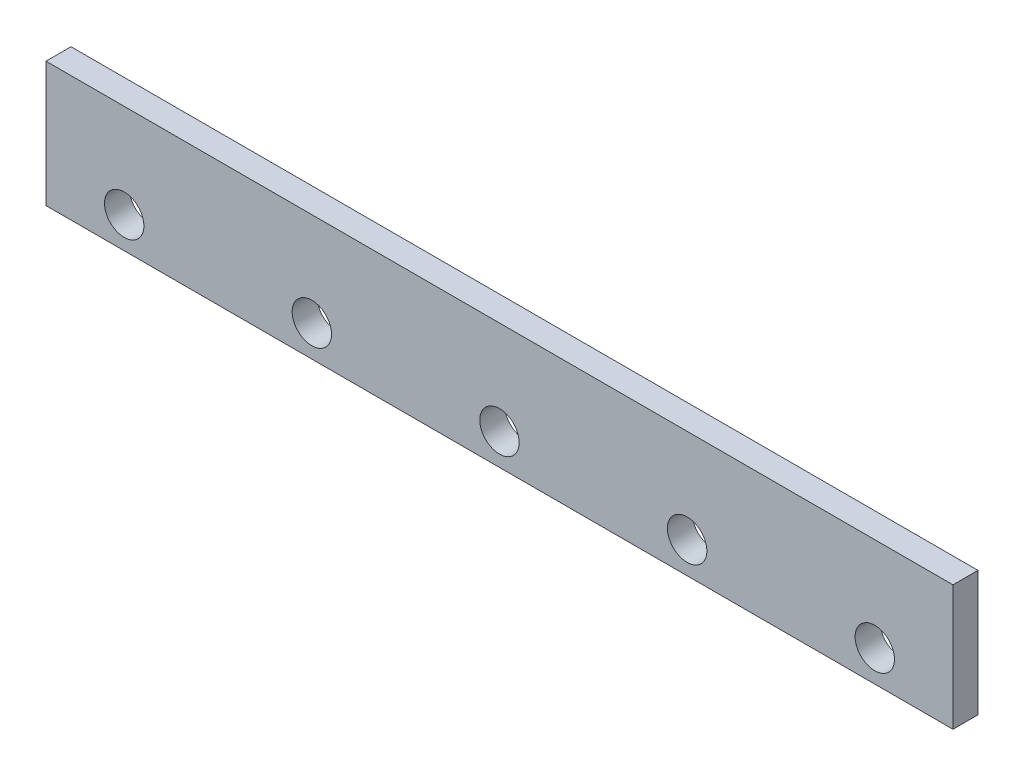
ISO-10303-21;
HEADER;
FILE_DESCRIPTION(('STEP AP214'),'2;1');
FILE_NAME('part.step','',(''),(''),'','','');
FILE_SCHEMA(('AUTOMOTIVE_DESIGN { 1 0 10303 214 1 1 1 1 }'));
ENDSEC;
DATA;
#1=APPLICATION_CONTEXT('core data for automotive mechanical design processes');
#2=APPLICATION_PROTOCOL_DEFINITION('international standard','automotive_design',2000,#1);
#3=PRODUCT_CONTEXT('',#1,'mechanical');
#4=PRODUCT('Part','Part','',(#3));
#5=PRODUCT_RELATED_PRODUCT_CATEGORY('part','',(#4));
#6=PRODUCT_DEFINITION_FORMATION('','',#4);
#7=PRODUCT_DEFINITION_CONTEXT('part definition',#1,'design');
#8=PRODUCT_DEFINITION('design','',#6,#7);
#9=PRODUCT_DEFINITION_SHAPE('','',#8);
#10=(LENGTH_UNIT() NAMED_UNIT(*) SI_UNIT(.MILLI.,.METRE.));
#11=(NAMED_UNIT(*) PLANE_ANGLE_UNIT() SI_UNIT($,.RADIAN.));
#12=(NAMED_UNIT(*) SI_UNIT($,.STERADIAN.) SOLID_ANGLE_UNIT());
#13=UNCERTAINTY_MEASURE_WITH_UNIT(LENGTH_MEASURE(1.E-05),#10,'distance_accuracy_value','');
#14=(GEOMETRIC_REPRESENTATION_CONTEXT(3) GLOBAL_UNCERTAINTY_ASSIGNED_CONTEXT((#13)) GLOBAL_UNIT_ASSIGNED_CONTEXT((#10,
#11,#12)) REPRESENTATION_CONTEXT('',''));
#15=CARTESIAN_POINT('',(0.,0.,0.));
#16=DIRECTION('',(0.,0.,1.));
#17=DIRECTION('',(1.,0.,0.));
#18=AXIS2_PLACEMENT_3D('',#15,#16,#17);
#19=CARTESIAN_POINT('',(-290.,-40.,16.));
#20=DIRECTION('',(1.,0.,0.));
#21=DIRECTION('',(0.,0.,-1.));
#22=AXIS2_PLACEMENT_3D('',#19,#20,#21);
#23=PLANE('',#22);
#24=DIRECTION('',(0.,-1.,0.));
#25=VECTOR('',#24,1.);
#26=CARTESIAN_POINT('',(-290.,-40.,0.));
#27=LINE('',#26,#25);
#28=CARTESIAN_POINT('',(-290.,40.,0.));
#29=VERTEX_POINT('',#28);
#30=CARTESIAN_POINT('',(-290.,-40.,0.));
#31=VERTEX_POINT('',#30);
#32=EDGE_CURVE('E96',#29,#31,#27,.T.);
#33=ORIENTED_EDGE('',*,*,#32,.T.);
#34=DIRECTION('',(0.,0.,-1.));
#35=VECTOR('',#34,1.);
#36=CARTESIAN_POINT('',(-290.,-40.,16.));
#37=LINE('',#36,#35);
#38=CARTESIAN_POINT('',(-290.,-40.,16.));
#39=VERTEX_POINT('',#38);
#40=EDGE_CURVE('E11',#39,#31,#37,.T.);
#41=ORIENTED_EDGE('',*,*,#40,.F.);
#42=DIRECTION('',(0.,-1.,0.));
#43=VECTOR('',#42,1.);
#44=CARTESIAN_POINT('',(-290.,-40.,16.));
#45=LINE('',#44,#43);
#46=CARTESIAN_POINT('',(-290.,40.,16.));
#47=VERTEX_POINT('',#46);
#48=EDGE_CURVE('E84',#47,#39,#45,.T.);
#49=ORIENTED_EDGE('',*,*,#48,.F.);
#50=DIRECTION('',(0.,0.,-1.));
#51=VECTOR('',#50,1.);
#52=CARTESIAN_POINT('',(-290.,40.,16.));
#53=LINE('',#52,#51);
#54=EDGE_CURVE('E92',#47,#29,#53,.T.);
#55=ORIENTED_EDGE('',*,*,#54,.T.);
#56=EDGE_LOOP('',(#33,#41,#49,#55));
#57=FACE_BOUND('',#56,.T.);
#58=ADVANCED_FACE('F33',(#57),#23,.F.);
#59=CARTESIAN_POINT('',(290.,-40.,16.));
#60=DIRECTION('',(0.,1.,0.));
#61=DIRECTION('',(-1.,0.,0.));
#62=AXIS2_PLACEMENT_3D('',#59,#60,#61);
#63=PLANE('',#62);
#64=DIRECTION('',(1.,0.,0.));
#65=VECTOR('',#64,1.);
#66=CARTESIAN_POINT('',(290.,-40.,0.));
#67=LINE('',#66,#65);
#68=CARTESIAN_POINT('',(290.,-40.,0.));
#69=VERTEX_POINT('',#68);
#70=EDGE_CURVE('E88',#31,#69,#67,.T.);
#71=ORIENTED_EDGE('',*,*,#70,.T.);
#72=DIRECTION('',(0.,0.,-1.));
#73=VECTOR('',#72,1.);
#74=CARTESIAN_POINT('',(290.,-40.,16.));
#75=LINE('',#74,#73);
#76=CARTESIAN_POINT('',(290.,-40.,16.));
#77=VERTEX_POINT('',#76);
#78=EDGE_CURVE('E41',#77,#69,#75,.T.);
#79=ORIENTED_EDGE('',*,*,#78,.F.);
#80=DIRECTION('',(1.,0.,0.));
#81=VECTOR('',#80,1.);
#82=CARTESIAN_POINT('',(290.,-40.,16.));
#83=LINE('',#82,#81);
#84=EDGE_CURVE('E79',#39,#77,#83,.T.);
#85=ORIENTED_EDGE('',*,*,#84,.F.);
#86=ORIENTED_EDGE('',*,*,#40,.T.);
#87=EDGE_LOOP('',(#71,#79,#85,#86));
#88=FACE_BOUND('',#87,.T.);
#89=ADVANCED_FACE('F87',(#88),#63,.F.);
#90=CARTESIAN_POINT('',(290.,-40.,16.));
#91=DIRECTION('',(-1.,0.,0.));
#92=DIRECTION('',(0.,0.,1.));
#93=AXIS2_PLACEMENT_3D('',#90,#91,#92);
#94=PLANE('',#93);
#95=DIRECTION('',(0.,1.,0.));
#96=VECTOR('',#95,1.);
#97=CARTESIAN_POINT('',(290.,-40.,0.));
#98=LINE('',#97,#96);
#99=CARTESIAN_POINT('',(290.,40.,0.));
#100=VERTEX_POINT('',#99);
#101=EDGE_CURVE('E66',#69,#100,#98,.T.);
#102=ORIENTED_EDGE('',*,*,#101,.T.);
#103=DIRECTION('',(0.,0.,-1.));
#104=VECTOR('',#103,1.);
#105=CARTESIAN_POINT('',(290.,40.,16.));
#106=LINE('',#105,#104);
#107=CARTESIAN_POINT('',(290.,40.,16.));
#108=VERTEX_POINT('',#107);
#109=EDGE_CURVE('E89',#108,#100,#106,.T.);
#110=ORIENTED_EDGE('',*,*,#109,.F.);
#111=DIRECTION('',(0.,1.,0.));
#112=VECTOR('',#111,1.);
#113=CARTESIAN_POINT('',(290.,-40.,16.));
#114=LINE('',#113,#112);
#115=EDGE_CURVE('E82',#77,#108,#114,.T.);
#116=ORIENTED_EDGE('',*,*,#115,.F.);
#117=ORIENTED_EDGE('',*,*,#78,.T.);
#118=EDGE_LOOP('',(#102,#110,#116,#117));
#119=FACE_BOUND('',#118,.T.);
#120=ADVANCED_FACE('F90',(#119),#94,.F.);
#121=CARTESIAN_POINT('',(290.,40.,16.));
#122=DIRECTION('',(0.,-1.,0.));
#123=DIRECTION('',(1.,0.,0.));
#124=AXIS2_PLACEMENT_3D('',#121,#122,#123);
#125=PLANE('',#124);
#126=DIRECTION('',(-1.,0.,0.));
#127=VECTOR('',#126,1.);
#128=CARTESIAN_POINT('',(290.,40.,0.));
#129=LINE('',#128,#127);
#130=EDGE_CURVE('E72',#100,#29,#129,.T.);
#131=ORIENTED_EDGE('',*,*,#130,.T.);
#132=ORIENTED_EDGE('',*,*,#54,.F.);
#133=DIRECTION('',(-1.,0.,0.));
#134=VECTOR('',#133,1.);
#135=CARTESIAN_POINT('',(290.,40.,16.));
#136=LINE('',#135,#134);
#137=EDGE_CURVE('E49',#108,#47,#136,.T.);
#138=ORIENTED_EDGE('',*,*,#137,.F.);
#139=ORIENTED_EDGE('',*,*,#109,.T.);
#140=EDGE_LOOP('',(#131,#132,#138,#139));
#141=FACE_BOUND('',#140,.T.);
#142=ADVANCED_FACE('F104',(#141),#125,.F.);
#143=CARTESIAN_POINT('',(0.,0.,16.));
#144=DIRECTION('',(0.,0.,1.));
#145=DIRECTION('',(1.,0.,0.));
#146=AXIS2_PLACEMENT_3D('',#143,#144,#145);
#147=PLANE('',#146);
#148=CARTESIAN_POINT('',(-240.,-20.,16.));
#149=DIRECTION('',(0.,0.,1.));
#150=DIRECTION('',(1.,0.,0.));
#151=AXIS2_PLACEMENT_3D('',#148,#149,#150);
#152=CIRCLE('',#151,12.6);
#153=CARTESIAN_POINT('',(-227.4,-20.,16.));
#154=VERTEX_POINT('',#153);
#155=EDGE_CURVE('E134',#154,#154,#152,.T.);
#156=ORIENTED_EDGE('',*,*,#155,.F.);
#157=EDGE_LOOP('',(#156));
#158=FACE_BOUND('',#157,.T.);
#159=CARTESIAN_POINT('',(-120.,-20.,16.));
#160=DIRECTION('',(0.,0.,1.));
#161=DIRECTION('',(1.,0.,0.));
#162=AXIS2_PLACEMENT_3D('',#159,#160,#161);
#163=CIRCLE('',#162,12.6);
#164=CARTESIAN_POINT('',(-107.4,-20.,16.));
#165=VERTEX_POINT('',#164);
#166=EDGE_CURVE('E128',#165,#165,#163,.T.);
#167=ORIENTED_EDGE('',*,*,#166,.F.);
#168=EDGE_LOOP('',(#167));
#169=FACE_BOUND('',#168,.T.);
#170=CARTESIAN_POINT('',(0.,-20.,16.));
#171=DIRECTION('',(0.,0.,1.));
#172=DIRECTION('',(1.,0.,0.));
#173=AXIS2_PLACEMENT_3D('',#170,#171,#172);
#174=CIRCLE('',#173,12.6);
#175=CARTESIAN_POINT('',(12.5999999999999,-20.,16.));
#176=VERTEX_POINT('',#175);
#177=EDGE_CURVE('E122',#176,#176,#174,.T.);
#178=ORIENTED_EDGE('',*,*,#177,.F.);
#179=EDGE_LOOP('',(#178));
#180=FACE_BOUND('',#179,.T.);
#181=CARTESIAN_POINT('',(120.,-20.,16.));
#182=DIRECTION('',(0.,0.,1.));
#183=DIRECTION('',(1.,0.,0.));
#184=AXIS2_PLACEMENT_3D('',#181,#182,#183);
#185=CIRCLE('',#184,12.6);
#186=CARTESIAN_POINT('',(132.6,-20.,16.));
#187=VERTEX_POINT('',#186);
#188=EDGE_CURVE('E116',#187,#187,#185,.T.);
#189=ORIENTED_EDGE('',*,*,#188,.F.);
#190=EDGE_LOOP('',(#189));
#191=FACE_BOUND('',#190,.T.);
#192=CARTESIAN_POINT('',(240.,-20.,16.));
#193=DIRECTION('',(0.,0.,1.));
#194=DIRECTION('',(1.,0.,0.));
#195=AXIS2_PLACEMENT_3D('',#192,#193,#194);
#196=CIRCLE('',#195,12.5999999999999);
#197=CARTESIAN_POINT('',(252.6,-20.,16.));
#198=VERTEX_POINT('',#197);
#199=EDGE_CURVE('E110',#198,#198,#196,.T.);
#200=ORIENTED_EDGE('',*,*,#199,.F.);
#201=EDGE_LOOP('',(#200));
#202=FACE_BOUND('',#201,.T.);
#203=ORIENTED_EDGE('',*,*,#48,.T.);
#204=ORIENTED_EDGE('',*,*,#84,.T.);
#205=ORIENTED_EDGE('',*,*,#115,.T.);
#206=ORIENTED_EDGE('',*,*,#137,.T.);
#207=EDGE_LOOP('',(#203,#204,#205,#206));
#208=FACE_BOUND('',#207,.T.);
#209=ADVANCED_FACE('F80',(#158,#169,#180,#191,#202,#208),#147,.T.);
#210=CARTESIAN_POINT('',(0.,0.,0.));
#211=DIRECTION('',(0.,0.,1.));
#212=DIRECTION('',(1.,0.,0.));
#213=AXIS2_PLACEMENT_3D('',#210,#211,#212);
#214=PLANE('',#213);
#215=CARTESIAN_POINT('',(-240.,-20.,0.));
#216=DIRECTION('',(0.,0.,1.));
#217=DIRECTION('',(1.,0.,0.));
#218=AXIS2_PLACEMENT_3D('',#215,#216,#217);
#219=CIRCLE('',#218,12.6);
#220=CARTESIAN_POINT('',(-227.4,-20.,0.));
#221=VERTEX_POINT('',#220);
#222=EDGE_CURVE('E99',#221,#221,#219,.T.);
#223=ORIENTED_EDGE('',*,*,#222,.T.);
#224=EDGE_LOOP('',(#223));
#225=FACE_BOUND('',#224,.T.);
#226=CARTESIAN_POINT('',(-120.,-20.,0.));
#227=DIRECTION('',(0.,0.,1.));
#228=DIRECTION('',(1.,0.,0.));
#229=AXIS2_PLACEMENT_3D('',#226,#227,#228);
#230=CIRCLE('',#229,12.6);
#231=CARTESIAN_POINT('',(-107.4,-20.,0.));
#232=VERTEX_POINT('',#231);
#233=EDGE_CURVE('E131',#232,#232,#230,.T.);
#234=ORIENTED_EDGE('',*,*,#233,.T.);
#235=EDGE_LOOP('',(#234));
#236=FACE_BOUND('',#235,.T.);
#237=CARTESIAN_POINT('',(0.,-20.,0.));
#238=DIRECTION('',(0.,0.,1.));
#239=DIRECTION('',(1.,0.,0.));
#240=AXIS2_PLACEMENT_3D('',#237,#238,#239);
#241=CIRCLE('',#240,12.6);
#242=CARTESIAN_POINT('',(12.5999999999999,-20.,0.));
#243=VERTEX_POINT('',#242);
#244=EDGE_CURVE('E125',#243,#243,#241,.T.);
#245=ORIENTED_EDGE('',*,*,#244,.T.);
#246=EDGE_LOOP('',(#245));
#247=FACE_BOUND('',#246,.T.);
#248=CARTESIAN_POINT('',(120.,-20.,0.));
#249=DIRECTION('',(0.,0.,1.));
#250=DIRECTION('',(1.,0.,0.));
#251=AXIS2_PLACEMENT_3D('',#248,#249,#250);
#252=CIRCLE('',#251,12.6);
#253=CARTESIAN_POINT('',(132.6,-20.,0.));
#254=VERTEX_POINT('',#253);
#255=EDGE_CURVE('E119',#254,#254,#252,.T.);
#256=ORIENTED_EDGE('',*,*,#255,.T.);
#257=EDGE_LOOP('',(#256));
#258=FACE_BOUND('',#257,.T.);
#259=CARTESIAN_POINT('',(240.,-20.,0.));
#260=DIRECTION('',(0.,0.,1.));
#261=DIRECTION('',(1.,0.,0.));
#262=AXIS2_PLACEMENT_3D('',#259,#260,#261);
#263=CIRCLE('',#262,12.5999999999999);
#264=CARTESIAN_POINT('',(252.6,-20.,0.));
#265=VERTEX_POINT('',#264);
#266=EDGE_CURVE('E113',#265,#265,#263,.T.);
#267=ORIENTED_EDGE('',*,*,#266,.T.);
#268=EDGE_LOOP('',(#267));
#269=FACE_BOUND('',#268,.T.);
#270=ORIENTED_EDGE('',*,*,#32,.F.);
#271=ORIENTED_EDGE('',*,*,#130,.F.);
#272=ORIENTED_EDGE('',*,*,#101,.F.);
#273=ORIENTED_EDGE('',*,*,#70,.F.);
#274=EDGE_LOOP('',(#270,#271,#272,#273));
#275=FACE_BOUND('',#274,.T.);
#276=ADVANCED_FACE('F107',(#225,#236,#247,#258,#269,#275),#214,.F.);
#277=CARTESIAN_POINT('',(240.,-20.,0.));
#278=DIRECTION('',(0.,0.,1.));
#279=DIRECTION('',(1.,0.,0.));
#280=AXIS2_PLACEMENT_3D('',#277,#278,#279);
#281=CYLINDRICAL_SURFACE('',#280,12.5999999999999);
#282=ORIENTED_EDGE('',*,*,#266,.F.);
#283=EDGE_LOOP('',(#282));
#284=FACE_BOUND('',#283,.T.);
#285=ORIENTED_EDGE('',*,*,#199,.T.);
#286=EDGE_LOOP('',(#285));
#287=FACE_BOUND('',#286,.T.);
#288=ADVANCED_FACE('F160',(#284,#287),#281,.F.);
#289=CARTESIAN_POINT('',(120.,-20.,0.));
#290=DIRECTION('',(0.,0.,1.));
#291=DIRECTION('',(1.,0.,0.));
#292=AXIS2_PLACEMENT_3D('',#289,#290,#291);
#293=CYLINDRICAL_SURFACE('',#292,12.6);
#294=ORIENTED_EDGE('',*,*,#255,.F.);
#295=EDGE_LOOP('',(#294));
#296=FACE_BOUND('',#295,.T.);
#297=ORIENTED_EDGE('',*,*,#188,.T.);
#298=EDGE_LOOP('',(#297));
#299=FACE_BOUND('',#298,.T.);
#300=ADVANCED_FACE('F162',(#296,#299),#293,.F.);
#301=CARTESIAN_POINT('',(0.,-20.,0.));
#302=DIRECTION('',(0.,0.,1.));
#303=DIRECTION('',(1.,0.,0.));
#304=AXIS2_PLACEMENT_3D('',#301,#302,#303);
#305=CYLINDRICAL_SURFACE('',#304,12.6);
#306=ORIENTED_EDGE('',*,*,#244,.F.);
#307=EDGE_LOOP('',(#306));
#308=FACE_BOUND('',#307,.T.);
#309=ORIENTED_EDGE('',*,*,#177,.T.);
#310=EDGE_LOOP('',(#309));
#311=FACE_BOUND('',#310,.T.);
#312=ADVANCED_FACE('F169',(#308,#311),#305,.F.);
#313=CARTESIAN_POINT('',(-120.,-20.,0.));
#314=DIRECTION('',(0.,0.,1.));
#315=DIRECTION('',(1.,0.,0.));
#316=AXIS2_PLACEMENT_3D('',#313,#314,#315);
#317=CYLINDRICAL_SURFACE('',#316,12.6);
#318=ORIENTED_EDGE('',*,*,#233,.F.);
#319=EDGE_LOOP('',(#318));
#320=FACE_BOUND('',#319,.T.);
#321=ORIENTED_EDGE('',*,*,#166,.T.);
#322=EDGE_LOOP('',(#321));
#323=FACE_BOUND('',#322,.T.);
#324=ADVANCED_FACE('F145',(#320,#323),#317,.F.);
#325=CARTESIAN_POINT('',(-240.,-20.,0.));
#326=DIRECTION('',(0.,0.,1.));
#327=DIRECTION('',(1.,0.,0.));
#328=AXIS2_PLACEMENT_3D('',#325,#326,#327);
#329=CYLINDRICAL_SURFACE('',#328,12.6);
#330=ORIENTED_EDGE('',*,*,#222,.F.);
#331=EDGE_LOOP('',(#330));
#332=FACE_BOUND('',#331,.T.);
#333=ORIENTED_EDGE('',*,*,#155,.T.);
#334=EDGE_LOOP('',(#333));
#335=FACE_BOUND('',#334,.T.);
#336=ADVANCED_FACE('F142',(#332,#335),#329,.F.);
#337=CLOSED_SHELL('',(#58,#89,#120,#142,#209,#276,#288,#300,#312,#324,#336));
#338=MANIFOLD_SOLID_BREP('B2',#337);
#339=ADVANCED_BREP_SHAPE_REPRESENTATION('',(#18,#338),#14);
#340=SHAPE_DEFINITION_REPRESENTATION(#9,#339);
ENDSEC;
END-ISO-10303-21;
